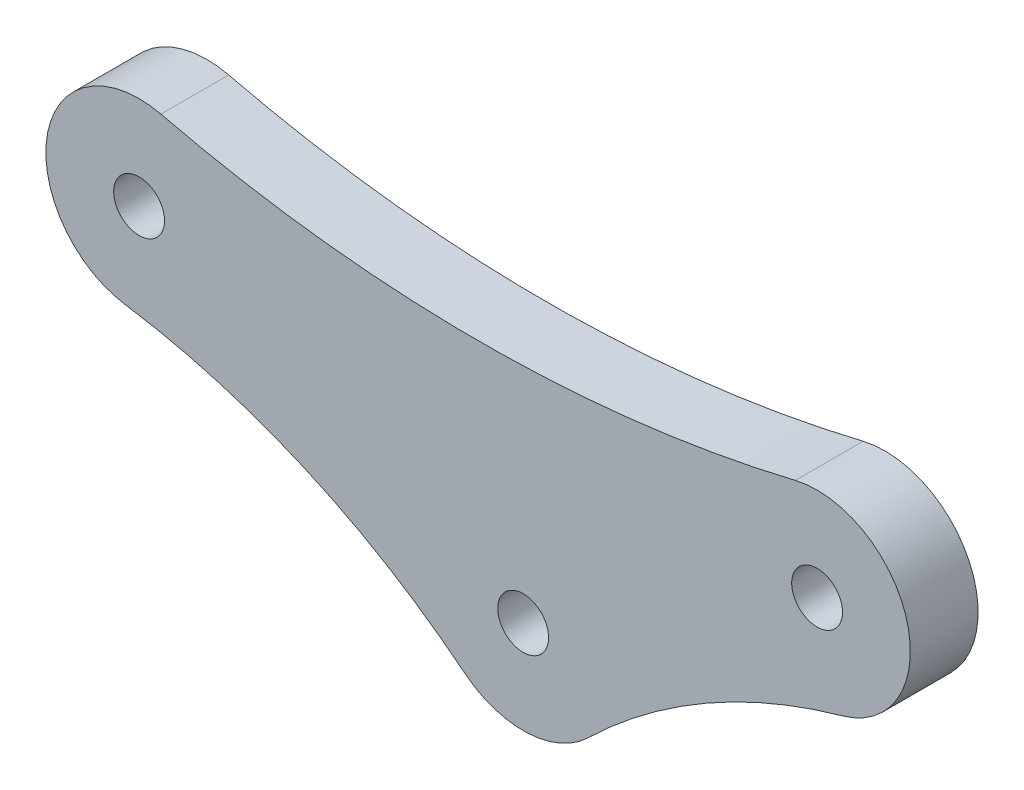
ISO-10303-21;
HEADER;
FILE_DESCRIPTION(('STEP AP214'),'2;1');
FILE_NAME('part.step','',(''),(''),'','','');
FILE_SCHEMA(('AUTOMOTIVE_DESIGN { 1 0 10303 214 1 1 1 1 }'));
ENDSEC;
DATA;
#1=APPLICATION_CONTEXT('core data for automotive mechanical design processes');
#2=APPLICATION_PROTOCOL_DEFINITION('international standard','automotive_design',2000,#1);
#3=PRODUCT_CONTEXT('',#1,'mechanical');
#4=PRODUCT('Part','Part','',(#3));
#5=PRODUCT_RELATED_PRODUCT_CATEGORY('part','',(#4));
#6=PRODUCT_DEFINITION_FORMATION('','',#4);
#7=PRODUCT_DEFINITION_CONTEXT('part definition',#1,'design');
#8=PRODUCT_DEFINITION('design','',#6,#7);
#9=PRODUCT_DEFINITION_SHAPE('','',#8);
#10=(LENGTH_UNIT() NAMED_UNIT(*) SI_UNIT(.MILLI.,.METRE.));
#11=(NAMED_UNIT(*) PLANE_ANGLE_UNIT() SI_UNIT($,.RADIAN.));
#12=(NAMED_UNIT(*) SI_UNIT($,.STERADIAN.) SOLID_ANGLE_UNIT());
#13=UNCERTAINTY_MEASURE_WITH_UNIT(LENGTH_MEASURE(1.E-05),#10,'distance_accuracy_value','');
#14=(GEOMETRIC_REPRESENTATION_CONTEXT(3) GLOBAL_UNCERTAINTY_ASSIGNED_CONTEXT((#13)) GLOBAL_UNIT_ASSIGNED_CONTEXT((#10,
#11,#12)) REPRESENTATION_CONTEXT('',''));
#15=CARTESIAN_POINT('',(0.,0.,0.));
#16=DIRECTION('',(0.,0.,1.));
#17=DIRECTION('',(1.,0.,0.));
#18=AXIS2_PLACEMENT_3D('',#15,#16,#17);
#19=CARTESIAN_POINT('',(10.9534535450797,-39.1256789773134,4.));
#20=DIRECTION('',(0.,0.,-1.));
#21=DIRECTION('',(-1.,0.,0.));
#22=AXIS2_PLACEMENT_3D('',#19,#20,#21);
#23=CYLINDRICAL_SURFACE('',#22,35.13);
#24=CARTESIAN_POINT('',(10.9534535450797,-39.1256789773134,0.));
#25=DIRECTION('',(0.,0.,1.));
#26=DIRECTION('',(1.,0.,0.));
#27=AXIS2_PLACEMENT_3D('',#24,#25,#26);
#28=CIRCLE('',#27,35.13);
#29=CARTESIAN_POINT('',(-13.5099730618278,-13.9134268238771,0.));
#30=VERTEX_POINT('',#29);
#31=CARTESIAN_POINT('',(1.48274660344421,-5.29636313992674,0.));
#32=VERTEX_POINT('',#31);
#33=EDGE_CURVE('E134',#30,#32,#28,.F.);
#34=ORIENTED_EDGE('',*,*,#33,.T.);
#35=DIRECTION('',(0.,0.,-1.));
#36=VECTOR('',#35,1.);
#37=CARTESIAN_POINT('',(1.48274660344421,-5.29636313992674,4.));
#38=LINE('',#37,#36);
#39=CARTESIAN_POINT('',(1.48274660344421,-5.29636313992674,4.));
#40=VERTEX_POINT('',#39);
#41=EDGE_CURVE('E11',#40,#32,#38,.T.);
#42=ORIENTED_EDGE('',*,*,#41,.F.);
#43=CARTESIAN_POINT('',(10.9534535450797,-39.1256789773134,4.));
#44=DIRECTION('',(0.,0.,1.));
#45=DIRECTION('',(1.,0.,0.));
#46=AXIS2_PLACEMENT_3D('',#43,#44,#45);
#47=CIRCLE('',#46,35.13);
#48=CARTESIAN_POINT('',(-13.5099730618278,-13.9134268238771,4.));
#49=VERTEX_POINT('',#48);
#50=EDGE_CURVE('E155',#49,#40,#47,.F.);
#51=ORIENTED_EDGE('',*,*,#50,.F.);
#52=DIRECTION('',(0.,0.,-1.));
#53=VECTOR('',#52,1.);
#54=CARTESIAN_POINT('',(-13.5099730618278,-13.9134268238771,4.));
#55=LINE('',#54,#53);
#56=EDGE_CURVE('E133',#49,#30,#55,.T.);
#57=ORIENTED_EDGE('',*,*,#56,.T.);
#58=EDGE_LOOP('',(#34,#42,#51,#57));
#59=FACE_BOUND('',#58,.T.);
#60=ADVANCED_FACE('F41',(#59),#23,.F.);
#61=CARTESIAN_POINT('',(0.,0.,4.));
#62=DIRECTION('',(0.,0.,-1.));
#63=DIRECTION('',(-1.,0.,0.));
#64=AXIS2_PLACEMENT_3D('',#61,#62,#63);
#65=CYLINDRICAL_SURFACE('',#64,5.5);
#66=CARTESIAN_POINT('',(0.,0.,0.));
#67=DIRECTION('',(0.,0.,1.));
#68=DIRECTION('',(1.,0.,0.));
#69=AXIS2_PLACEMENT_3D('',#66,#67,#68);
#70=CIRCLE('',#69,5.5);
#71=CARTESIAN_POINT('',(-1.28654970760234,5.34740963924294,0.));
#72=VERTEX_POINT('',#71);
#73=EDGE_CURVE('E137',#32,#72,#70,.T.);
#74=ORIENTED_EDGE('',*,*,#73,.T.);
#75=DIRECTION('',(0.,0.,-1.));
#76=VECTOR('',#75,1.);
#77=CARTESIAN_POINT('',(-1.28654970760234,5.34740963924294,4.));
#78=LINE('',#77,#76);
#79=CARTESIAN_POINT('',(-1.28654970760234,5.34740963924294,4.));
#80=VERTEX_POINT('',#79);
#81=EDGE_CURVE('E49',#80,#72,#78,.T.);
#82=ORIENTED_EDGE('',*,*,#81,.F.);
#83=CARTESIAN_POINT('',(0.,0.,4.));
#84=DIRECTION('',(0.,0.,1.));
#85=DIRECTION('',(1.,0.,0.));
#86=AXIS2_PLACEMENT_3D('',#83,#84,#85);
#87=CIRCLE('',#86,5.5);
#88=EDGE_CURVE('E94',#40,#80,#87,.T.);
#89=ORIENTED_EDGE('',*,*,#88,.F.);
#90=ORIENTED_EDGE('',*,*,#41,.T.);
#91=EDGE_LOOP('',(#74,#82,#89,#90));
#92=FACE_BOUND('',#91,.T.);
#93=ADVANCED_FACE('F161',(#92),#65,.T.);
#94=CARTESIAN_POINT('',(-20.,83.1279134827767,4.));
#95=DIRECTION('',(0.,0.,-1.));
#96=DIRECTION('',(-1.,0.,0.));
#97=AXIS2_PLACEMENT_3D('',#94,#95,#96);
#98=CYLINDRICAL_SURFACE('',#97,80.);
#99=CARTESIAN_POINT('',(-20.,83.1279134827767,0.));
#100=DIRECTION('',(0.,0.,1.));
#101=DIRECTION('',(1.,0.,0.));
#102=AXIS2_PLACEMENT_3D('',#99,#100,#101);
#103=CIRCLE('',#102,80.);
#104=CARTESIAN_POINT('',(-38.7134502923977,5.34740963924294,0.));
#105=VERTEX_POINT('',#104);
#106=EDGE_CURVE('E140',#105,#72,#103,.T.);
#107=ORIENTED_EDGE('',*,*,#106,.F.);
#108=DIRECTION('',(0.,0.,-1.));
#109=VECTOR('',#108,1.);
#110=CARTESIAN_POINT('',(-38.7134502923977,5.34740963924294,4.));
#111=LINE('',#110,#109);
#112=CARTESIAN_POINT('',(-38.7134502923977,5.34740963924294,4.));
#113=VERTEX_POINT('',#112);
#114=EDGE_CURVE('E116',#113,#105,#111,.T.);
#115=ORIENTED_EDGE('',*,*,#114,.F.);
#116=CARTESIAN_POINT('',(-20.,83.1279134827767,4.));
#117=DIRECTION('',(0.,0.,1.));
#118=DIRECTION('',(1.,0.,0.));
#119=AXIS2_PLACEMENT_3D('',#116,#117,#118);
#120=CIRCLE('',#119,80.);
#121=EDGE_CURVE('E109',#113,#80,#120,.T.);
#122=ORIENTED_EDGE('',*,*,#121,.T.);
#123=ORIENTED_EDGE('',*,*,#81,.T.);
#124=EDGE_LOOP('',(#107,#115,#122,#123));
#125=FACE_BOUND('',#124,.T.);
#126=ADVANCED_FACE('F160',(#125),#98,.F.);
#127=CARTESIAN_POINT('',(-40.,0.,4.));
#128=DIRECTION('',(0.,0.,-1.));
#129=DIRECTION('',(-1.,0.,0.));
#130=AXIS2_PLACEMENT_3D('',#127,#128,#129);
#131=CYLINDRICAL_SURFACE('',#130,5.5);
#132=CARTESIAN_POINT('',(-40.,0.,0.));
#133=DIRECTION('',(0.,0.,1.));
#134=DIRECTION('',(1.,0.,0.));
#135=AXIS2_PLACEMENT_3D('',#132,#133,#134);
#136=CIRCLE('',#135,5.5);
#137=CARTESIAN_POINT('',(-40.8258826348141,-5.43763899808662,0.));
#138=VERTEX_POINT('',#137);
#139=EDGE_CURVE('E115',#105,#138,#136,.T.);
#140=ORIENTED_EDGE('',*,*,#139,.T.);
#141=DIRECTION('',(0.,0.,-1.));
#142=VECTOR('',#141,1.);
#143=CARTESIAN_POINT('',(-40.8258826348141,-5.43763899808662,4.));
#144=LINE('',#143,#142);
#145=CARTESIAN_POINT('',(-40.8258826348141,-5.43763899808662,4.));
#146=VERTEX_POINT('',#145);
#147=EDGE_CURVE('E112',#146,#138,#144,.T.);
#148=ORIENTED_EDGE('',*,*,#147,.F.);
#149=CARTESIAN_POINT('',(-40.,0.,4.));
#150=DIRECTION('',(0.,0.,1.));
#151=DIRECTION('',(1.,0.,0.));
#152=AXIS2_PLACEMENT_3D('',#149,#150,#151);
#153=CIRCLE('',#152,5.5);
#154=EDGE_CURVE('E102',#113,#146,#153,.T.);
#155=ORIENTED_EDGE('',*,*,#154,.F.);
#156=ORIENTED_EDGE('',*,*,#114,.T.);
#157=EDGE_LOOP('',(#140,#148,#155,#156));
#158=FACE_BOUND('',#157,.T.);
#159=ADVANCED_FACE('F113',(#158),#131,.T.);
#160=CARTESIAN_POINT('',(-47.1326227552129,-46.9614277107481,4.));
#161=DIRECTION('',(0.,0.,-1.));
#162=DIRECTION('',(-1.,0.,0.));
#163=AXIS2_PLACEMENT_3D('',#160,#161,#162);
#164=CYLINDRICAL_SURFACE('',#163,42.);
#165=CARTESIAN_POINT('',(-47.1326227552129,-46.9614277107481,0.));
#166=DIRECTION('',(0.,0.,1.));
#167=DIRECTION('',(1.,0.,0.));
#168=AXIS2_PLACEMENT_3D('',#165,#166,#167);
#169=CIRCLE('',#168,42.);
#170=CARTESIAN_POINT('',(-20.7896721084983,-14.2498250104101,0.));
#171=VERTEX_POINT('',#170);
#172=EDGE_CURVE('E80',#138,#171,#169,.F.);
#173=ORIENTED_EDGE('',*,*,#172,.T.);
#174=DIRECTION('',(0.,0.,-1.));
#175=VECTOR('',#174,1.);
#176=CARTESIAN_POINT('',(-20.7896721084983,-14.2498250104101,4.));
#177=LINE('',#176,#175);
#178=CARTESIAN_POINT('',(-20.7896721084983,-14.2498250104101,4.));
#179=VERTEX_POINT('',#178);
#180=EDGE_CURVE('E117',#179,#171,#177,.T.);
#181=ORIENTED_EDGE('',*,*,#180,.F.);
#182=CARTESIAN_POINT('',(-47.1326227552129,-46.9614277107481,4.));
#183=DIRECTION('',(0.,0.,1.));
#184=DIRECTION('',(1.,0.,0.));
#185=AXIS2_PLACEMENT_3D('',#182,#183,#184);
#186=CIRCLE('',#185,42.);
#187=EDGE_CURVE('E107',#146,#179,#186,.F.);
#188=ORIENTED_EDGE('',*,*,#187,.F.);
#189=ORIENTED_EDGE('',*,*,#147,.T.);
#190=EDGE_LOOP('',(#173,#181,#188,#189));
#191=FACE_BOUND('',#190,.T.);
#192=ADVANCED_FACE('F119',(#191),#164,.F.);
#193=CARTESIAN_POINT('',(-17.34,-9.96616275203249,4.));
#194=DIRECTION('',(0.,0.,-1.));
#195=DIRECTION('',(-1.,0.,0.));
#196=AXIS2_PLACEMENT_3D('',#193,#194,#195);
#197=CYLINDRICAL_SURFACE('',#196,1.5);
#198=CARTESIAN_POINT('',(-17.34,-9.96616275203249,4.));
#199=DIRECTION('',(0.,0.,1.));
#200=DIRECTION('',(1.,0.,0.));
#201=AXIS2_PLACEMENT_3D('',#198,#199,#200);
#202=CIRCLE('',#201,1.5);
#203=CARTESIAN_POINT('',(-15.84,-9.96616275203249,4.));
#204=VERTEX_POINT('',#203);
#205=EDGE_CURVE('E127',#204,#204,#202,.T.);
#206=ORIENTED_EDGE('',*,*,#205,.T.);
#207=EDGE_LOOP('',(#206));
#208=FACE_BOUND('',#207,.T.);
#209=CARTESIAN_POINT('',(-17.34,-9.96616275203249,0.));
#210=DIRECTION('',(0.,0.,1.));
#211=DIRECTION('',(1.,0.,0.));
#212=AXIS2_PLACEMENT_3D('',#209,#210,#211);
#213=CIRCLE('',#212,1.5);
#214=CARTESIAN_POINT('',(-15.84,-9.96616275203249,0.));
#215=VERTEX_POINT('',#214);
#216=EDGE_CURVE('E149',#215,#215,#213,.T.);
#217=ORIENTED_EDGE('',*,*,#216,.F.);
#218=EDGE_LOOP('',(#217));
#219=FACE_BOUND('',#218,.T.);
#220=ADVANCED_FACE('F180',(#208,#219),#197,.F.);
#221=CARTESIAN_POINT('',(-40.,0.,4.));
#222=DIRECTION('',(0.,0.,-1.));
#223=DIRECTION('',(-1.,0.,0.));
#224=AXIS2_PLACEMENT_3D('',#221,#222,#223);
#225=CYLINDRICAL_SURFACE('',#224,1.5);
#226=CARTESIAN_POINT('',(-40.,0.,4.));
#227=DIRECTION('',(0.,0.,1.));
#228=DIRECTION('',(1.,0.,0.));
#229=AXIS2_PLACEMENT_3D('',#226,#227,#228);
#230=CIRCLE('',#229,1.5);
#231=CARTESIAN_POINT('',(-38.5,0.,4.));
#232=VERTEX_POINT('',#231);
#233=EDGE_CURVE('E121',#232,#232,#230,.T.);
#234=ORIENTED_EDGE('',*,*,#233,.T.);
#235=EDGE_LOOP('',(#234));
#236=FACE_BOUND('',#235,.T.);
#237=CARTESIAN_POINT('',(-40.,0.,0.));
#238=DIRECTION('',(0.,0.,1.));
#239=DIRECTION('',(1.,0.,0.));
#240=AXIS2_PLACEMENT_3D('',#237,#238,#239);
#241=CIRCLE('',#240,1.5);
#242=CARTESIAN_POINT('',(-38.5,0.,0.));
#243=VERTEX_POINT('',#242);
#244=EDGE_CURVE('E146',#243,#243,#241,.T.);
#245=ORIENTED_EDGE('',*,*,#244,.F.);
#246=EDGE_LOOP('',(#245));
#247=FACE_BOUND('',#246,.T.);
#248=ADVANCED_FACE('F172',(#236,#247),#225,.F.);
#249=CARTESIAN_POINT('',(-17.34,-9.96616275203249,4.));
#250=DIRECTION('',(0.,0.,-1.));
#251=DIRECTION('',(-1.,0.,0.));
#252=AXIS2_PLACEMENT_3D('',#249,#250,#251);
#253=CYLINDRICAL_SURFACE('',#252,5.5);
#254=CARTESIAN_POINT('',(-17.34,-9.96616275203249,0.));
#255=DIRECTION('',(0.,0.,1.));
#256=DIRECTION('',(1.,0.,0.));
#257=AXIS2_PLACEMENT_3D('',#254,#255,#256);
#258=CIRCLE('',#257,5.5);
#259=EDGE_CURVE('E86',#171,#30,#258,.T.);
#260=ORIENTED_EDGE('',*,*,#259,.T.);
#261=ORIENTED_EDGE('',*,*,#56,.F.);
#262=CARTESIAN_POINT('',(-17.34,-9.96616275203249,4.));
#263=DIRECTION('',(0.,0.,1.));
#264=DIRECTION('',(1.,0.,0.));
#265=AXIS2_PLACEMENT_3D('',#262,#263,#264);
#266=CIRCLE('',#265,5.5);
#267=EDGE_CURVE('E57',#179,#49,#266,.T.);
#268=ORIENTED_EDGE('',*,*,#267,.F.);
#269=ORIENTED_EDGE('',*,*,#180,.T.);
#270=EDGE_LOOP('',(#260,#261,#268,#269));
#271=FACE_BOUND('',#270,.T.);
#272=ADVANCED_FACE('F169',(#271),#253,.T.);
#273=CARTESIAN_POINT('',(0.,0.,4.));
#274=DIRECTION('',(0.,0.,-1.));
#275=DIRECTION('',(-1.,0.,0.));
#276=AXIS2_PLACEMENT_3D('',#273,#274,#275);
#277=CYLINDRICAL_SURFACE('',#276,1.5);
#278=CARTESIAN_POINT('',(0.,0.,4.));
#279=DIRECTION('',(0.,0.,1.));
#280=DIRECTION('',(1.,0.,0.));
#281=AXIS2_PLACEMENT_3D('',#278,#279,#280);
#282=CIRCLE('',#281,1.5);
#283=CARTESIAN_POINT('',(1.5,0.,4.));
#284=VERTEX_POINT('',#283);
#285=EDGE_CURVE('E130',#284,#284,#282,.T.);
#286=ORIENTED_EDGE('',*,*,#285,.T.);
#287=EDGE_LOOP('',(#286));
#288=FACE_BOUND('',#287,.T.);
#289=CARTESIAN_POINT('',(0.,0.,0.));
#290=DIRECTION('',(0.,0.,1.));
#291=DIRECTION('',(1.,0.,0.));
#292=AXIS2_PLACEMENT_3D('',#289,#290,#291);
#293=CIRCLE('',#292,1.5);
#294=CARTESIAN_POINT('',(1.5,0.,0.));
#295=VERTEX_POINT('',#294);
#296=EDGE_CURVE('E152',#295,#295,#293,.T.);
#297=ORIENTED_EDGE('',*,*,#296,.F.);
#298=EDGE_LOOP('',(#297));
#299=FACE_BOUND('',#298,.T.);
#300=ADVANCED_FACE('F171',(#288,#299),#277,.F.);
#301=CARTESIAN_POINT('',(0.,0.,4.));
#302=DIRECTION('',(0.,0.,1.));
#303=DIRECTION('',(1.,0.,0.));
#304=AXIS2_PLACEMENT_3D('',#301,#302,#303);
#305=PLANE('',#304);
#306=ORIENTED_EDGE('',*,*,#50,.T.);
#307=ORIENTED_EDGE('',*,*,#88,.T.);
#308=ORIENTED_EDGE('',*,*,#121,.F.);
#309=ORIENTED_EDGE('',*,*,#154,.T.);
#310=ORIENTED_EDGE('',*,*,#187,.T.);
#311=ORIENTED_EDGE('',*,*,#267,.T.);
#312=EDGE_LOOP('',(#306,#307,#308,#309,#310,#311));
#313=FACE_BOUND('',#312,.T.);
#314=ORIENTED_EDGE('',*,*,#233,.F.);
#315=EDGE_LOOP('',(#314));
#316=FACE_BOUND('',#315,.T.);
#317=ORIENTED_EDGE('',*,*,#205,.F.);
#318=EDGE_LOOP('',(#317));
#319=FACE_BOUND('',#318,.T.);
#320=ORIENTED_EDGE('',*,*,#285,.F.);
#321=EDGE_LOOP('',(#320));
#322=FACE_BOUND('',#321,.T.);
#323=ADVANCED_FACE('F104',(#313,#316,#319,#322),#305,.T.);
#324=CARTESIAN_POINT('',(0.,0.,0.));
#325=DIRECTION('',(0.,0.,1.));
#326=DIRECTION('',(1.,0.,0.));
#327=AXIS2_PLACEMENT_3D('',#324,#325,#326);
#328=PLANE('',#327);
#329=ORIENTED_EDGE('',*,*,#33,.F.);
#330=ORIENTED_EDGE('',*,*,#259,.F.);
#331=ORIENTED_EDGE('',*,*,#172,.F.);
#332=ORIENTED_EDGE('',*,*,#139,.F.);
#333=ORIENTED_EDGE('',*,*,#106,.T.);
#334=ORIENTED_EDGE('',*,*,#73,.F.);
#335=EDGE_LOOP('',(#329,#330,#331,#332,#333,#334));
#336=FACE_BOUND('',#335,.T.);
#337=ORIENTED_EDGE('',*,*,#244,.T.);
#338=EDGE_LOOP('',(#337));
#339=FACE_BOUND('',#338,.T.);
#340=ORIENTED_EDGE('',*,*,#216,.T.);
#341=EDGE_LOOP('',(#340));
#342=FACE_BOUND('',#341,.T.);
#343=ORIENTED_EDGE('',*,*,#296,.T.);
#344=EDGE_LOOP('',(#343));
#345=FACE_BOUND('',#344,.T.);
#346=ADVANCED_FACE('F165',(#336,#339,#342,#345),#328,.F.);
#347=CLOSED_SHELL('',(#60,#93,#126,#159,#192,#220,#248,#272,#300,#323,#346));
#348=MANIFOLD_SOLID_BREP('B2',#347);
#349=ADVANCED_BREP_SHAPE_REPRESENTATION('',(#18,#348),#14);
#350=SHAPE_DEFINITION_REPRESENTATION(#9,#349);
ENDSEC;
END-ISO-10303-21;
